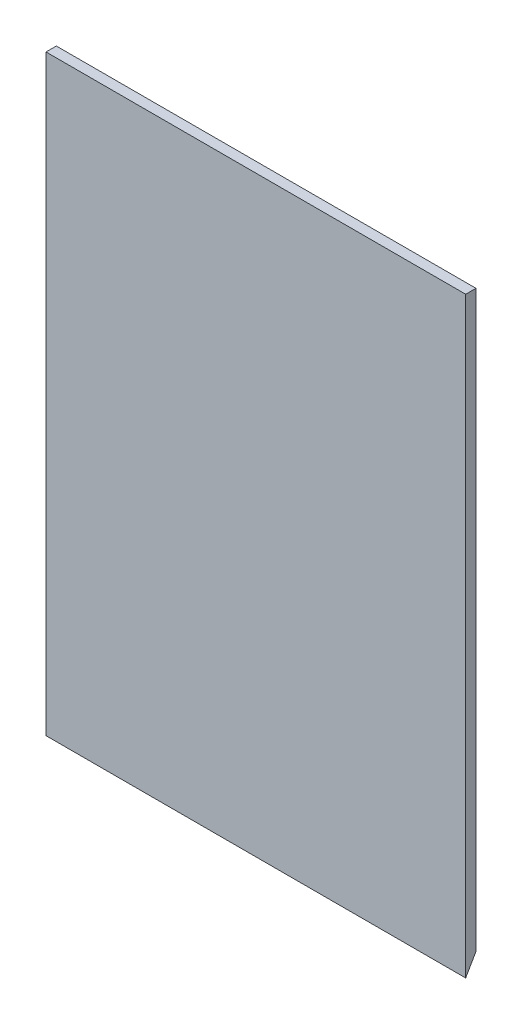
ISO-10303-21;
HEADER;
FILE_DESCRIPTION(('STEP AP214'),'2;1');
FILE_NAME('part.step','',(''),(''),'','','');
FILE_SCHEMA(('AUTOMOTIVE_DESIGN { 1 0 10303 214 1 1 1 1 }'));
ENDSEC;
DATA;
#1=APPLICATION_CONTEXT('core data for automotive mechanical design processes');
#2=APPLICATION_PROTOCOL_DEFINITION('international standard','automotive_design',2000,#1);
#3=PRODUCT_CONTEXT('',#1,'mechanical');
#4=PRODUCT('Part','Part','',(#3));
#5=PRODUCT_RELATED_PRODUCT_CATEGORY('part','',(#4));
#6=PRODUCT_DEFINITION_FORMATION('','',#4);
#7=PRODUCT_DEFINITION_CONTEXT('part definition',#1,'design');
#8=PRODUCT_DEFINITION('design','',#6,#7);
#9=PRODUCT_DEFINITION_SHAPE('','',#8);
#10=(LENGTH_UNIT() NAMED_UNIT(*) SI_UNIT(.MILLI.,.METRE.));
#11=(NAMED_UNIT(*) PLANE_ANGLE_UNIT() SI_UNIT($,.RADIAN.));
#12=(NAMED_UNIT(*) SI_UNIT($,.STERADIAN.) SOLID_ANGLE_UNIT());
#13=UNCERTAINTY_MEASURE_WITH_UNIT(LENGTH_MEASURE(1.E-05),#10,'distance_accuracy_value','');
#14=(GEOMETRIC_REPRESENTATION_CONTEXT(3) GLOBAL_UNCERTAINTY_ASSIGNED_CONTEXT((#13)) GLOBAL_UNIT_ASSIGNED_CONTEXT((#10,
#11,#12)) REPRESENTATION_CONTEXT('',''));
#15=CARTESIAN_POINT('',(0.,0.,0.));
#16=DIRECTION('',(0.,0.,1.));
#17=DIRECTION('',(1.,0.,0.));
#18=AXIS2_PLACEMENT_3D('',#15,#16,#17);
#19=CARTESIAN_POINT('',(-103.505,-146.05,2.54));
#20=DIRECTION('',(0.,1.,0.));
#21=DIRECTION('',(0.,0.,1.));
#22=AXIS2_PLACEMENT_3D('',#19,#20,#21);
#23=PLANE('',#22);
#24=DIRECTION('',(1.,0.,0.));
#25=VECTOR('',#24,1.);
#26=CARTESIAN_POINT('',(-103.505,-146.05,-2.54));
#27=LINE('',#26,#25);
#28=CARTESIAN_POINT('',(-97.155,-146.05,-2.54));
#29=VERTEX_POINT('',#28);
#30=CARTESIAN_POINT('',(97.155,-146.05,-2.54));
#31=VERTEX_POINT('',#30);
#32=EDGE_CURVE('E133',#29,#31,#27,.T.);
#33=ORIENTED_EDGE('',*,*,#32,.T.);
#34=DIRECTION('',(0.,0.,-1.));
#35=VECTOR('',#34,1.);
#36=CARTESIAN_POINT('',(97.155,-146.05,2.54));
#37=LINE('',#36,#35);
#38=CARTESIAN_POINT('',(97.155,-146.05,2.54));
#39=VERTEX_POINT('',#38);
#40=EDGE_CURVE('E51',#39,#31,#37,.T.);
#41=ORIENTED_EDGE('',*,*,#40,.F.);
#42=DIRECTION('',(1.,0.,0.));
#43=VECTOR('',#42,1.);
#44=CARTESIAN_POINT('',(-103.505,-146.05,2.54));
#45=LINE('',#44,#43);
#46=CARTESIAN_POINT('',(-97.155,-146.05,2.54));
#47=VERTEX_POINT('',#46);
#48=EDGE_CURVE('E138',#47,#39,#45,.T.);
#49=ORIENTED_EDGE('',*,*,#48,.F.);
#50=DIRECTION('',(0.,0.,1.));
#51=VECTOR('',#50,1.);
#52=CARTESIAN_POINT('',(-97.155,-146.05,2.54));
#53=LINE('',#52,#51);
#54=EDGE_CURVE('E122',#29,#47,#53,.T.);
#55=ORIENTED_EDGE('',*,*,#54,.F.);
#56=EDGE_LOOP('',(#33,#41,#49,#55));
#57=FACE_BOUND('',#56,.T.);
#58=ADVANCED_FACE('F36',(#57),#23,.F.);
#59=CARTESIAN_POINT('',(103.505,146.05,2.54));
#60=DIRECTION('',(-1.,0.,0.));
#61=DIRECTION('',(0.,-1.,0.));
#62=AXIS2_PLACEMENT_3D('',#59,#60,#61);
#63=PLANE('',#62);
#64=DIRECTION('',(0.,1.,0.));
#65=VECTOR('',#64,1.);
#66=CARTESIAN_POINT('',(103.505,146.05,2.54));
#67=LINE('',#66,#65);
#68=CARTESIAN_POINT('',(103.505,-146.05,2.54));
#69=VERTEX_POINT('',#68);
#70=CARTESIAN_POINT('',(103.505,146.05,2.54));
#71=VERTEX_POINT('',#70);
#72=EDGE_CURVE('E129',#69,#71,#67,.T.);
#73=ORIENTED_EDGE('',*,*,#72,.F.);
#74=DIRECTION('',(0.,-0.866025403784436,0.500000000000004));
#75=VECTOR('',#74,1.);
#76=CARTESIAN_POINT('',(103.505,-137.25118189755,-2.54));
#77=LINE('',#76,#75);
#78=CARTESIAN_POINT('',(103.505,-137.25118189755,-2.54));
#79=VERTEX_POINT('',#78);
#80=EDGE_CURVE('E108',#79,#69,#77,.T.);
#81=ORIENTED_EDGE('',*,*,#80,.F.);
#82=DIRECTION('',(0.,1.,0.));
#83=VECTOR('',#82,1.);
#84=CARTESIAN_POINT('',(103.505,146.05,-2.54));
#85=LINE('',#84,#83);
#86=CARTESIAN_POINT('',(103.505,146.05,-2.54));
#87=VERTEX_POINT('',#86);
#88=EDGE_CURVE('E113',#79,#87,#85,.T.);
#89=ORIENTED_EDGE('',*,*,#88,.T.);
#90=DIRECTION('',(0.,0.,-1.));
#91=VECTOR('',#90,1.);
#92=CARTESIAN_POINT('',(103.505,146.05,2.54));
#93=LINE('',#92,#91);
#94=EDGE_CURVE('E11',#71,#87,#93,.T.);
#95=ORIENTED_EDGE('',*,*,#94,.F.);
#96=EDGE_LOOP('',(#73,#81,#89,#95));
#97=FACE_BOUND('',#96,.T.);
#98=ADVANCED_FACE('F38',(#97),#63,.F.);
#99=CARTESIAN_POINT('',(-103.505,146.05,2.54));
#100=DIRECTION('',(0.,-1.,0.));
#101=DIRECTION('',(0.,0.,-1.));
#102=AXIS2_PLACEMENT_3D('',#99,#100,#101);
#103=PLANE('',#102);
#104=DIRECTION('',(-1.,0.,0.));
#105=VECTOR('',#104,1.);
#106=CARTESIAN_POINT('',(-103.505,146.05,-2.54));
#107=LINE('',#106,#105);
#108=CARTESIAN_POINT('',(-103.505,146.05,-2.54));
#109=VERTEX_POINT('',#108);
#110=EDGE_CURVE('E143',#87,#109,#107,.T.);
#111=ORIENTED_EDGE('',*,*,#110,.T.);
#112=DIRECTION('',(0.,0.,-1.));
#113=VECTOR('',#112,1.);
#114=CARTESIAN_POINT('',(-103.505,146.05,2.54));
#115=LINE('',#114,#113);
#116=CARTESIAN_POINT('',(-103.505,146.05,2.54));
#117=VERTEX_POINT('',#116);
#118=EDGE_CURVE('E44',#117,#109,#115,.T.);
#119=ORIENTED_EDGE('',*,*,#118,.F.);
#120=DIRECTION('',(-1.,0.,0.));
#121=VECTOR('',#120,1.);
#122=CARTESIAN_POINT('',(-103.505,146.05,2.54));
#123=LINE('',#122,#121);
#124=EDGE_CURVE('E132',#71,#117,#123,.T.);
#125=ORIENTED_EDGE('',*,*,#124,.F.);
#126=ORIENTED_EDGE('',*,*,#94,.T.);
#127=EDGE_LOOP('',(#111,#119,#125,#126));
#128=FACE_BOUND('',#127,.T.);
#129=ADVANCED_FACE('F165',(#128),#103,.F.);
#130=CARTESIAN_POINT('',(-103.505,146.05,2.54));
#131=DIRECTION('',(1.,0.,0.));
#132=DIRECTION('',(0.,1.,0.));
#133=AXIS2_PLACEMENT_3D('',#130,#131,#132);
#134=PLANE('',#133);
#135=DIRECTION('',(0.,-1.,0.));
#136=VECTOR('',#135,1.);
#137=CARTESIAN_POINT('',(-103.505,146.05,-2.54));
#138=LINE('',#137,#136);
#139=CARTESIAN_POINT('',(-103.505,-137.25118189755,-2.54));
#140=VERTEX_POINT('',#139);
#141=EDGE_CURVE('E145',#109,#140,#138,.T.);
#142=ORIENTED_EDGE('',*,*,#141,.T.);
#143=DIRECTION('',(0.,0.866025403784436,-0.500000000000004));
#144=VECTOR('',#143,1.);
#145=CARTESIAN_POINT('',(-103.505,-137.25118189755,-2.54));
#146=LINE('',#145,#144);
#147=CARTESIAN_POINT('',(-103.505,-146.05,2.54));
#148=VERTEX_POINT('',#147);
#149=EDGE_CURVE('E115',#148,#140,#146,.T.);
#150=ORIENTED_EDGE('',*,*,#149,.F.);
#151=DIRECTION('',(0.,-1.,0.));
#152=VECTOR('',#151,1.);
#153=CARTESIAN_POINT('',(-103.505,146.05,2.54));
#154=LINE('',#153,#152);
#155=EDGE_CURVE('E135',#117,#148,#154,.T.);
#156=ORIENTED_EDGE('',*,*,#155,.F.);
#157=ORIENTED_EDGE('',*,*,#118,.T.);
#158=EDGE_LOOP('',(#142,#150,#156,#157));
#159=FACE_BOUND('',#158,.T.);
#160=ADVANCED_FACE('F153',(#159),#134,.F.);
#161=CARTESIAN_POINT('',(0.,0.,2.54));
#162=DIRECTION('',(0.,0.,1.));
#163=DIRECTION('',(1.,0.,0.));
#164=AXIS2_PLACEMENT_3D('',#161,#162,#163);
#165=PLANE('',#164);
#166=ORIENTED_EDGE('',*,*,#72,.T.);
#167=ORIENTED_EDGE('',*,*,#124,.T.);
#168=ORIENTED_EDGE('',*,*,#155,.T.);
#169=EDGE_CURVE('E139',#148,#47,#45,.T.);
#170=ORIENTED_EDGE('',*,*,#169,.T.);
#171=ORIENTED_EDGE('',*,*,#48,.T.);
#172=DIRECTION('',(1.,0.,0.));
#173=VECTOR('',#172,1.);
#174=CARTESIAN_POINT('',(97.155,-146.05,2.54));
#175=LINE('',#174,#173);
#176=EDGE_CURVE('E101',#39,#69,#175,.T.);
#177=ORIENTED_EDGE('',*,*,#176,.T.);
#178=EDGE_LOOP('',(#166,#167,#168,#170,#171,#177));
#179=FACE_BOUND('',#178,.T.);
#180=ADVANCED_FACE('F161',(#179),#165,.T.);
#181=CARTESIAN_POINT('',(0.,0.,-2.54));
#182=DIRECTION('',(0.,0.,1.));
#183=DIRECTION('',(1.,0.,0.));
#184=AXIS2_PLACEMENT_3D('',#181,#182,#183);
#185=PLANE('',#184);
#186=ORIENTED_EDGE('',*,*,#88,.F.);
#187=DIRECTION('',(1.,0.,0.));
#188=VECTOR('',#187,1.);
#189=CARTESIAN_POINT('',(97.155,-137.25118189755,-2.54));
#190=LINE('',#189,#188);
#191=CARTESIAN_POINT('',(97.155,-137.25118189755,-2.54));
#192=VERTEX_POINT('',#191);
#193=EDGE_CURVE('E98',#192,#79,#190,.T.);
#194=ORIENTED_EDGE('',*,*,#193,.F.);
#195=DIRECTION('',(0.,1.,0.));
#196=VECTOR('',#195,1.);
#197=CARTESIAN_POINT('',(97.155,-146.05,-2.54));
#198=LINE('',#197,#196);
#199=EDGE_CURVE('E102',#31,#192,#198,.T.);
#200=ORIENTED_EDGE('',*,*,#199,.F.);
#201=ORIENTED_EDGE('',*,*,#32,.F.);
#202=DIRECTION('',(0.,-1.,0.));
#203=VECTOR('',#202,1.);
#204=CARTESIAN_POINT('',(-97.155,-146.05,-2.54));
#205=LINE('',#204,#203);
#206=CARTESIAN_POINT('',(-97.155,-137.25118189755,-2.54));
#207=VERTEX_POINT('',#206);
#208=EDGE_CURVE('E120',#207,#29,#205,.T.);
#209=ORIENTED_EDGE('',*,*,#208,.F.);
#210=DIRECTION('',(-1.,0.,0.));
#211=VECTOR('',#210,1.);
#212=CARTESIAN_POINT('',(-97.155,-137.25118189755,-2.54));
#213=LINE('',#212,#211);
#214=EDGE_CURVE('E125',#207,#140,#213,.T.);
#215=ORIENTED_EDGE('',*,*,#214,.T.);
#216=ORIENTED_EDGE('',*,*,#141,.F.);
#217=ORIENTED_EDGE('',*,*,#110,.F.);
#218=EDGE_LOOP('',(#186,#194,#200,#201,#209,#215,#216,#217));
#219=FACE_BOUND('',#218,.T.);
#220=ADVANCED_FACE('F111',(#219),#185,.F.);
#221=CARTESIAN_POINT('',(-97.155,-137.25118189755,-2.54));
#222=DIRECTION('',(0.,0.500000000000004,0.866025403784436));
#223=DIRECTION('',(0.,-0.866025403784437,0.500000000000004));
#224=AXIS2_PLACEMENT_3D('',#221,#222,#223);
#225=PLANE('',#224);
#226=ORIENTED_EDGE('',*,*,#149,.T.);
#227=ORIENTED_EDGE('',*,*,#214,.F.);
#228=DIRECTION('',(0.,0.866025403784436,-0.500000000000004));
#229=VECTOR('',#228,1.);
#230=CARTESIAN_POINT('',(-97.155,-137.25118189755,-2.54));
#231=LINE('',#230,#229);
#232=EDGE_CURVE('E59',#47,#207,#231,.T.);
#233=ORIENTED_EDGE('',*,*,#232,.F.);
#234=ORIENTED_EDGE('',*,*,#169,.F.);
#235=EDGE_LOOP('',(#226,#227,#233,#234));
#236=FACE_BOUND('',#235,.T.);
#237=ADVANCED_FACE('F158',(#236),#225,.F.);
#238=CARTESIAN_POINT('',(-97.1550000000002,-1.62346446611539E-13,0.));
#239=DIRECTION('',(-1.,0.,0.));
#240=DIRECTION('',(0.,-1.,0.));
#241=AXIS2_PLACEMENT_3D('',#238,#239,#240);
#242=PLANE('',#241);
#243=ORIENTED_EDGE('',*,*,#208,.T.);
#244=ORIENTED_EDGE('',*,*,#54,.T.);
#245=ORIENTED_EDGE('',*,*,#232,.T.);
#246=EDGE_LOOP('',(#243,#244,#245));
#247=FACE_BOUND('',#246,.T.);
#248=ADVANCED_FACE('F169',(#247),#242,.T.);
#249=CARTESIAN_POINT('',(97.155,-137.25118189755,-2.54));
#250=DIRECTION('',(0.,0.500000000000004,0.866025403784436));
#251=DIRECTION('',(0.,-0.866025403784437,0.500000000000004));
#252=AXIS2_PLACEMENT_3D('',#249,#250,#251);
#253=PLANE('',#252);
#254=ORIENTED_EDGE('',*,*,#80,.T.);
#255=ORIENTED_EDGE('',*,*,#176,.F.);
#256=DIRECTION('',(0.,-0.866025403784436,0.500000000000004));
#257=VECTOR('',#256,1.);
#258=CARTESIAN_POINT('',(97.155,-137.25118189755,-2.54));
#259=LINE('',#258,#257);
#260=EDGE_CURVE('E95',#192,#39,#259,.T.);
#261=ORIENTED_EDGE('',*,*,#260,.F.);
#262=ORIENTED_EDGE('',*,*,#193,.T.);
#263=EDGE_LOOP('',(#254,#255,#261,#262));
#264=FACE_BOUND('',#263,.T.);
#265=ADVANCED_FACE('F96',(#264),#253,.F.);
#266=CARTESIAN_POINT('',(97.1549999999998,1.62346446611538E-13,0.));
#267=DIRECTION('',(-1.,0.,0.));
#268=DIRECTION('',(0.,-1.,0.));
#269=AXIS2_PLACEMENT_3D('',#266,#267,#268);
#270=PLANE('',#269);
#271=ORIENTED_EDGE('',*,*,#199,.T.);
#272=ORIENTED_EDGE('',*,*,#260,.T.);
#273=ORIENTED_EDGE('',*,*,#40,.T.);
#274=EDGE_LOOP('',(#271,#272,#273));
#275=FACE_BOUND('',#274,.T.);
#276=ADVANCED_FACE('F104',(#275),#270,.F.);
#277=CLOSED_SHELL('',(#58,#98,#129,#160,#180,#220,#237,#248,#265,#276));
#278=MANIFOLD_SOLID_BREP('B2',#277);
#279=ADVANCED_BREP_SHAPE_REPRESENTATION('',(#18,#278),#14);
#280=SHAPE_DEFINITION_REPRESENTATION(#9,#279);
ENDSEC;
END-ISO-10303-21;
